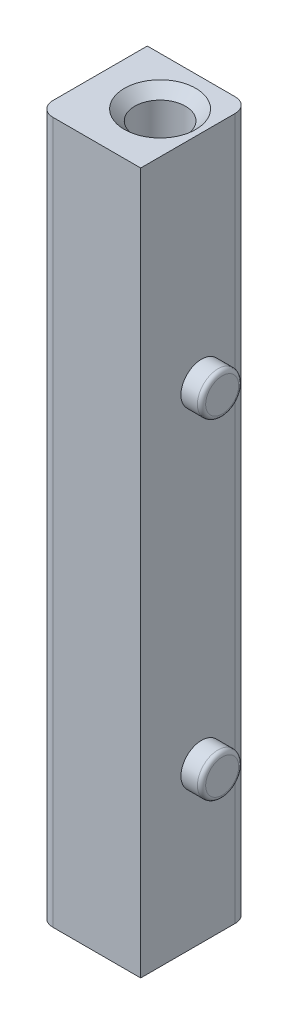
ISO-10303-21;
HEADER;
FILE_DESCRIPTION(('STEP AP214'),'2;1');
FILE_NAME('part.step','',(''),(''),'','','');
FILE_SCHEMA(('AUTOMOTIVE_DESIGN { 1 0 10303 214 1 1 1 1 }'));
ENDSEC;
DATA;
#1=APPLICATION_CONTEXT('core data for automotive mechanical design processes');
#2=APPLICATION_PROTOCOL_DEFINITION('international standard','automotive_design',2000,#1);
#3=PRODUCT_CONTEXT('',#1,'mechanical');
#4=PRODUCT('Part','Part','',(#3));
#5=PRODUCT_RELATED_PRODUCT_CATEGORY('part','',(#4));
#6=PRODUCT_DEFINITION_FORMATION('','',#4);
#7=PRODUCT_DEFINITION_CONTEXT('part definition',#1,'design');
#8=PRODUCT_DEFINITION('design','',#6,#7);
#9=PRODUCT_DEFINITION_SHAPE('','',#8);
#10=(LENGTH_UNIT() NAMED_UNIT(*) SI_UNIT(.MILLI.,.METRE.));
#11=(NAMED_UNIT(*) PLANE_ANGLE_UNIT() SI_UNIT($,.RADIAN.));
#12=(NAMED_UNIT(*) SI_UNIT($,.STERADIAN.) SOLID_ANGLE_UNIT());
#13=UNCERTAINTY_MEASURE_WITH_UNIT(LENGTH_MEASURE(1.E-05),#10,'distance_accuracy_value','');
#14=(GEOMETRIC_REPRESENTATION_CONTEXT(3) GLOBAL_UNCERTAINTY_ASSIGNED_CONTEXT((#13)) GLOBAL_UNIT_ASSIGNED_CONTEXT((#10,
#11,#12)) REPRESENTATION_CONTEXT('',''));
#15=CARTESIAN_POINT('',(0.,0.,0.));
#16=DIRECTION('',(0.,0.,1.));
#17=DIRECTION('',(1.,0.,0.));
#18=AXIS2_PLACEMENT_3D('',#15,#16,#17);
#19=CARTESIAN_POINT('',(5.1054,-39.37,-5.9182));
#20=DIRECTION('',(1.,0.,0.));
#21=DIRECTION('',(0.,0.,-1.));
#22=AXIS2_PLACEMENT_3D('',#19,#20,#21);
#23=PLANE('',#22);
#24=CARTESIAN_POINT('',(5.1054,20.32,0.));
#25=DIRECTION('',(1.,0.,0.));
#26=DIRECTION('',(0.,0.,-1.));
#27=AXIS2_PLACEMENT_3D('',#24,#25,#26);
#28=CIRCLE('',#27,2.54);
#29=CARTESIAN_POINT('',(5.1054,20.32,-2.54));
#30=VERTEX_POINT('',#29);
#31=EDGE_CURVE('E133',#30,#30,#28,.T.);
#32=ORIENTED_EDGE('',*,*,#31,.F.);
#33=EDGE_LOOP('',(#32));
#34=FACE_BOUND('',#33,.T.);
#35=DIRECTION('',(0.,0.,-1.));
#36=VECTOR('',#35,1.);
#37=CARTESIAN_POINT('',(5.1054,-39.37,-5.9182));
#38=LINE('',#37,#36);
#39=CARTESIAN_POINT('',(5.1054,-39.37,7.493));
#40=VERTEX_POINT('',#39);
#41=CARTESIAN_POINT('',(5.1054,-39.37,-4.1402));
#42=VERTEX_POINT('',#41);
#43=EDGE_CURVE('E122',#40,#42,#38,.T.);
#44=ORIENTED_EDGE('',*,*,#43,.T.);
#45=DIRECTION('',(0.,1.,0.));
#46=VECTOR('',#45,1.);
#47=CARTESIAN_POINT('',(5.1054,-39.37,-4.1402));
#48=LINE('',#47,#46);
#49=CARTESIAN_POINT('',(5.1054,46.99,-4.1402));
#50=VERTEX_POINT('',#49);
#51=EDGE_CURVE('E112',#42,#50,#48,.T.);
#52=ORIENTED_EDGE('',*,*,#51,.T.);
#53=DIRECTION('',(0.,0.,-1.));
#54=VECTOR('',#53,1.);
#55=CARTESIAN_POINT('',(5.1054,46.99,-5.9182));
#56=LINE('',#55,#54);
#57=CARTESIAN_POINT('',(5.1054,46.99,7.493));
#58=VERTEX_POINT('',#57);
#59=EDGE_CURVE('E94',#58,#50,#56,.T.);
#60=ORIENTED_EDGE('',*,*,#59,.F.);
#61=DIRECTION('',(0.,1.,0.));
#62=VECTOR('',#61,1.);
#63=CARTESIAN_POINT('',(5.1054,-39.37,7.493));
#64=LINE('',#63,#62);
#65=EDGE_CURVE('E101',#40,#58,#64,.T.);
#66=ORIENTED_EDGE('',*,*,#65,.F.);
#67=EDGE_LOOP('',(#44,#52,#60,#66));
#68=FACE_BOUND('',#67,.T.);
#69=CARTESIAN_POINT('',(5.1054,-20.32,0.));
#70=DIRECTION('',(1.,0.,0.));
#71=DIRECTION('',(0.,0.,-1.));
#72=AXIS2_PLACEMENT_3D('',#69,#70,#71);
#73=CIRCLE('',#72,2.54);
#74=CARTESIAN_POINT('',(5.1054,-20.32,-2.54));
#75=VERTEX_POINT('',#74);
#76=EDGE_CURVE('E208',#75,#75,#73,.T.);
#77=ORIENTED_EDGE('',*,*,#76,.F.);
#78=EDGE_LOOP('',(#77));
#79=FACE_BOUND('',#78,.T.);
#80=ADVANCED_FACE('F34',(#34,#68,#79),#23,.T.);
#81=CARTESIAN_POINT('',(-7.493,-39.37,-5.9182));
#82=DIRECTION('',(-1.,0.,0.));
#83=DIRECTION('',(0.,0.,1.));
#84=AXIS2_PLACEMENT_3D('',#81,#82,#83);
#85=PLANE('',#84);
#86=DIRECTION('',(0.,0.,1.));
#87=VECTOR('',#86,1.);
#88=CARTESIAN_POINT('',(-7.493,-39.37,-5.9182));
#89=LINE('',#88,#87);
#90=CARTESIAN_POINT('',(-7.493,-39.37,-5.9182));
#91=VERTEX_POINT('',#90);
#92=CARTESIAN_POINT('',(-7.493,-39.37,5.715));
#93=VERTEX_POINT('',#92);
#94=EDGE_CURVE('E115',#91,#93,#89,.T.);
#95=ORIENTED_EDGE('',*,*,#94,.T.);
#96=DIRECTION('',(0.,1.,0.));
#97=VECTOR('',#96,1.);
#98=CARTESIAN_POINT('',(-7.493,-39.37,5.715));
#99=LINE('',#98,#97);
#100=CARTESIAN_POINT('',(-7.493,46.99,5.715));
#101=VERTEX_POINT('',#100);
#102=EDGE_CURVE('E142',#93,#101,#99,.T.);
#103=ORIENTED_EDGE('',*,*,#102,.T.);
#104=DIRECTION('',(0.,0.,1.));
#105=VECTOR('',#104,1.);
#106=CARTESIAN_POINT('',(-7.493,46.99,-5.9182));
#107=LINE('',#106,#105);
#108=CARTESIAN_POINT('',(-7.493,46.99,-5.9182));
#109=VERTEX_POINT('',#108);
#110=EDGE_CURVE('E98',#109,#101,#107,.T.);
#111=ORIENTED_EDGE('',*,*,#110,.F.);
#112=DIRECTION('',(0.,1.,0.));
#113=VECTOR('',#112,1.);
#114=CARTESIAN_POINT('',(-7.493,-39.37,-5.9182));
#115=LINE('',#114,#113);
#116=EDGE_CURVE('E106',#91,#109,#115,.T.);
#117=ORIENTED_EDGE('',*,*,#116,.F.);
#118=EDGE_LOOP('',(#95,#103,#111,#117));
#119=FACE_BOUND('',#118,.T.);
#120=ADVANCED_FACE('F170',(#119),#85,.T.);
#121=CARTESIAN_POINT('',(-7.493,-39.37,-5.9182));
#122=DIRECTION('',(0.,0.,-1.));
#123=DIRECTION('',(-1.,0.,0.));
#124=AXIS2_PLACEMENT_3D('',#121,#122,#123);
#125=PLANE('',#124);
#126=DIRECTION('',(-1.,0.,0.));
#127=VECTOR('',#126,1.);
#128=CARTESIAN_POINT('',(-7.493,46.99,-5.9182));
#129=LINE('',#128,#127);
#130=CARTESIAN_POINT('',(3.3274,46.99,-5.9182));
#131=VERTEX_POINT('',#130);
#132=EDGE_CURVE('E113',#131,#109,#129,.T.);
#133=ORIENTED_EDGE('',*,*,#132,.F.);
#134=DIRECTION('',(0.,1.,0.));
#135=VECTOR('',#134,1.);
#136=CARTESIAN_POINT('',(3.3274,-39.37,-5.9182));
#137=LINE('',#136,#135);
#138=CARTESIAN_POINT('',(3.3274,-39.37,-5.9182));
#139=VERTEX_POINT('',#138);
#140=EDGE_CURVE('E57',#131,#139,#137,.F.);
#141=ORIENTED_EDGE('',*,*,#140,.T.);
#142=DIRECTION('',(-1.,0.,0.));
#143=VECTOR('',#142,1.);
#144=CARTESIAN_POINT('',(-7.493,-39.37,-5.9182));
#145=LINE('',#144,#143);
#146=EDGE_CURVE('E107',#139,#91,#145,.T.);
#147=ORIENTED_EDGE('',*,*,#146,.T.);
#148=ORIENTED_EDGE('',*,*,#116,.T.);
#149=EDGE_LOOP('',(#133,#141,#147,#148));
#150=FACE_BOUND('',#149,.T.);
#151=ADVANCED_FACE('F176',(#150),#125,.T.);
#152=CARTESIAN_POINT('',(-7.493,-39.37,7.493));
#153=DIRECTION('',(0.,0.,1.));
#154=DIRECTION('',(1.,0.,0.));
#155=AXIS2_PLACEMENT_3D('',#152,#153,#154);
#156=PLANE('',#155);
#157=DIRECTION('',(1.,0.,0.));
#158=VECTOR('',#157,1.);
#159=CARTESIAN_POINT('',(-7.493,46.99,7.493));
#160=LINE('',#159,#158);
#161=CARTESIAN_POINT('',(-5.715,46.99,7.493));
#162=VERTEX_POINT('',#161);
#163=EDGE_CURVE('E89',#162,#58,#160,.T.);
#164=ORIENTED_EDGE('',*,*,#163,.F.);
#165=DIRECTION('',(0.,1.,0.));
#166=VECTOR('',#165,1.);
#167=CARTESIAN_POINT('',(-5.715,-39.37,7.493));
#168=LINE('',#167,#166);
#169=CARTESIAN_POINT('',(-5.715,-39.37,7.493));
#170=VERTEX_POINT('',#169);
#171=EDGE_CURVE('E148',#162,#170,#168,.F.);
#172=ORIENTED_EDGE('',*,*,#171,.T.);
#173=DIRECTION('',(1.,0.,0.));
#174=VECTOR('',#173,1.);
#175=CARTESIAN_POINT('',(-7.493,-39.37,7.493));
#176=LINE('',#175,#174);
#177=EDGE_CURVE('E104',#170,#40,#176,.T.);
#178=ORIENTED_EDGE('',*,*,#177,.T.);
#179=ORIENTED_EDGE('',*,*,#65,.T.);
#180=EDGE_LOOP('',(#164,#172,#178,#179));
#181=FACE_BOUND('',#180,.T.);
#182=ADVANCED_FACE('F102',(#181),#156,.T.);
#183=CARTESIAN_POINT('',(-7.493,-39.37,7.493));
#184=DIRECTION('',(0.,1.,0.));
#185=DIRECTION('',(0.,0.,1.));
#186=AXIS2_PLACEMENT_3D('',#183,#184,#185);
#187=PLANE('',#186);
#188=CARTESIAN_POINT('',(0.,-39.37,0.));
#189=DIRECTION('',(0.,1.,0.));
#190=DIRECTION('',(0.,0.,1.));
#191=AXIS2_PLACEMENT_3D('',#188,#189,#190);
#192=CIRCLE('',#191,3.1242);
#193=CARTESIAN_POINT('',(0.,-39.37,3.1242));
#194=VERTEX_POINT('',#193);
#195=EDGE_CURVE('E206',#194,#194,#192,.T.);
#196=ORIENTED_EDGE('',*,*,#195,.T.);
#197=EDGE_LOOP('',(#196));
#198=FACE_BOUND('',#197,.T.);
#199=ORIENTED_EDGE('',*,*,#177,.F.);
#200=CARTESIAN_POINT('',(-5.715,-39.37,5.715));
#201=DIRECTION('',(0.,1.,0.));
#202=DIRECTION('',(0.,0.,1.));
#203=AXIS2_PLACEMENT_3D('',#200,#201,#202);
#204=CIRCLE('',#203,1.778);
#205=EDGE_CURVE('E151',#170,#93,#204,.F.);
#206=ORIENTED_EDGE('',*,*,#205,.T.);
#207=ORIENTED_EDGE('',*,*,#94,.F.);
#208=ORIENTED_EDGE('',*,*,#146,.F.);
#209=CARTESIAN_POINT('',(3.3274,-39.37,-4.1402));
#210=DIRECTION('',(0.,1.,0.));
#211=DIRECTION('',(0.,0.,1.));
#212=AXIS2_PLACEMENT_3D('',#209,#210,#211);
#213=CIRCLE('',#212,1.778);
#214=EDGE_CURVE('E49',#139,#42,#213,.F.);
#215=ORIENTED_EDGE('',*,*,#214,.T.);
#216=ORIENTED_EDGE('',*,*,#43,.F.);
#217=EDGE_LOOP('',(#199,#206,#207,#208,#215,#216));
#218=FACE_BOUND('',#217,.T.);
#219=ADVANCED_FACE('F184',(#198,#218),#187,.F.);
#220=CARTESIAN_POINT('',(-7.493,46.99,7.493));
#221=DIRECTION('',(0.,1.,0.));
#222=DIRECTION('',(0.,0.,1.));
#223=AXIS2_PLACEMENT_3D('',#220,#221,#222);
#224=PLANE('',#223);
#225=CARTESIAN_POINT('',(0.,46.99,0.));
#226=DIRECTION('',(0.,1.,0.));
#227=DIRECTION('',(0.,0.,1.));
#228=AXIS2_PLACEMENT_3D('',#225,#226,#227);
#229=CIRCLE('',#228,4.39419999999997);
#230=CARTESIAN_POINT('',(0.,46.99,4.39419999999997));
#231=VERTEX_POINT('',#230);
#232=EDGE_CURVE('E11',#231,#231,#229,.F.);
#233=ORIENTED_EDGE('',*,*,#232,.T.);
#234=EDGE_LOOP('',(#233));
#235=FACE_BOUND('',#234,.T.);
#236=ORIENTED_EDGE('',*,*,#110,.T.);
#237=CARTESIAN_POINT('',(-5.715,46.99,5.715));
#238=DIRECTION('',(0.,1.,0.));
#239=DIRECTION('',(0.,0.,1.));
#240=AXIS2_PLACEMENT_3D('',#237,#238,#239);
#241=CIRCLE('',#240,1.778);
#242=EDGE_CURVE('E95',#101,#162,#241,.T.);
#243=ORIENTED_EDGE('',*,*,#242,.T.);
#244=ORIENTED_EDGE('',*,*,#163,.T.);
#245=ORIENTED_EDGE('',*,*,#59,.T.);
#246=CARTESIAN_POINT('',(3.3274,46.99,-4.1402));
#247=DIRECTION('',(0.,1.,0.));
#248=DIRECTION('',(0.,0.,1.));
#249=AXIS2_PLACEMENT_3D('',#246,#247,#248);
#250=CIRCLE('',#249,1.778);
#251=EDGE_CURVE('E145',#50,#131,#250,.T.);
#252=ORIENTED_EDGE('',*,*,#251,.T.);
#253=ORIENTED_EDGE('',*,*,#132,.T.);
#254=EDGE_LOOP('',(#236,#243,#244,#245,#252,#253));
#255=FACE_BOUND('',#254,.T.);
#256=ADVANCED_FACE('F92',(#235,#255),#224,.T.);
#257=CARTESIAN_POINT('',(0.,-39.37,0.));
#258=DIRECTION('',(0.,1.,0.));
#259=DIRECTION('',(0.,0.,1.));
#260=AXIS2_PLACEMENT_3D('',#257,#258,#259);
#261=CYLINDRICAL_SURFACE('',#260,3.1242);
#262=CARTESIAN_POINT('',(0.,45.72,0.));
#263=DIRECTION('',(0.,1.,0.));
#264=DIRECTION('',(0.,0.,1.));
#265=AXIS2_PLACEMENT_3D('',#262,#263,#264);
#266=CIRCLE('',#265,3.1242);
#267=CARTESIAN_POINT('',(0.,45.72,3.1242));
#268=VERTEX_POINT('',#267);
#269=EDGE_CURVE('E42',#268,#268,#266,.T.);
#270=ORIENTED_EDGE('',*,*,#269,.T.);
#271=EDGE_LOOP('',(#270));
#272=FACE_BOUND('',#271,.T.);
#273=ORIENTED_EDGE('',*,*,#195,.F.);
#274=EDGE_LOOP('',(#273));
#275=FACE_BOUND('',#274,.T.);
#276=ADVANCED_FACE('F157',(#272,#275),#261,.F.);
#277=CARTESIAN_POINT('',(7.6454,-20.32,0.));
#278=DIRECTION('',(-1.,0.,0.));
#279=DIRECTION('',(0.,0.,1.));
#280=AXIS2_PLACEMENT_3D('',#277,#278,#279);
#281=CYLINDRICAL_SURFACE('',#280,2.54);
#282=CARTESIAN_POINT('',(7.1374,-20.32,0.));
#283=DIRECTION('',(1.,0.,0.));
#284=DIRECTION('',(0.,0.,-1.));
#285=AXIS2_PLACEMENT_3D('',#282,#283,#284);
#286=CIRCLE('',#285,2.54);
#287=CARTESIAN_POINT('',(7.1374,-20.32,-2.54));
#288=VERTEX_POINT('',#287);
#289=EDGE_CURVE('E130',#288,#288,#286,.F.);
#290=ORIENTED_EDGE('',*,*,#289,.T.);
#291=EDGE_LOOP('',(#290));
#292=FACE_BOUND('',#291,.T.);
#293=ORIENTED_EDGE('',*,*,#76,.T.);
#294=EDGE_LOOP('',(#293));
#295=FACE_BOUND('',#294,.T.);
#296=ADVANCED_FACE('F214',(#292,#295),#281,.T.);
#297=CARTESIAN_POINT('',(7.6454,-20.32,0.));
#298=DIRECTION('',(1.,0.,0.));
#299=DIRECTION('',(0.,0.,-1.));
#300=AXIS2_PLACEMENT_3D('',#297,#298,#299);
#301=PLANE('',#300);
#302=CARTESIAN_POINT('',(7.6454,-20.32,0.));
#303=DIRECTION('',(1.,0.,0.));
#304=DIRECTION('',(0.,0.,-1.));
#305=AXIS2_PLACEMENT_3D('',#302,#303,#304);
#306=CIRCLE('',#305,2.032);
#307=CARTESIAN_POINT('',(7.6454,-20.32,-2.032));
#308=VERTEX_POINT('',#307);
#309=EDGE_CURVE('E126',#308,#308,#306,.T.);
#310=ORIENTED_EDGE('',*,*,#309,.T.);
#311=EDGE_LOOP('',(#310));
#312=FACE_BOUND('',#311,.T.);
#313=ADVANCED_FACE('F190',(#312),#301,.T.);
#314=CARTESIAN_POINT('',(7.1374,-20.32,0.));
#315=DIRECTION('',(1.,0.,0.));
#316=DIRECTION('',(0.,0.,-1.));
#317=AXIS2_PLACEMENT_3D('',#314,#315,#316);
#318=TOROIDAL_SURFACE('',#317,2.032,0.508);
#319=ORIENTED_EDGE('',*,*,#289,.F.);
#320=EDGE_LOOP('',(#319));
#321=FACE_BOUND('',#320,.T.);
#322=ORIENTED_EDGE('',*,*,#309,.F.);
#323=EDGE_LOOP('',(#322));
#324=FACE_BOUND('',#323,.T.);
#325=ADVANCED_FACE('F186',(#321,#324),#318,.T.);
#326=CARTESIAN_POINT('',(7.6454,20.32,0.));
#327=DIRECTION('',(-1.,0.,0.));
#328=DIRECTION('',(0.,0.,1.));
#329=AXIS2_PLACEMENT_3D('',#326,#327,#328);
#330=CYLINDRICAL_SURFACE('',#329,2.54);
#331=CARTESIAN_POINT('',(7.1374,20.32,0.));
#332=DIRECTION('',(1.,0.,0.));
#333=DIRECTION('',(0.,0.,-1.));
#334=AXIS2_PLACEMENT_3D('',#331,#332,#333);
#335=CIRCLE('',#334,2.54);
#336=CARTESIAN_POINT('',(7.1374,20.32,-2.54));
#337=VERTEX_POINT('',#336);
#338=EDGE_CURVE('E136',#337,#337,#335,.F.);
#339=ORIENTED_EDGE('',*,*,#338,.T.);
#340=EDGE_LOOP('',(#339));
#341=FACE_BOUND('',#340,.T.);
#342=ORIENTED_EDGE('',*,*,#31,.T.);
#343=EDGE_LOOP('',(#342));
#344=FACE_BOUND('',#343,.T.);
#345=ADVANCED_FACE('F189',(#341,#344),#330,.T.);
#346=CARTESIAN_POINT('',(7.6454,20.32,0.));
#347=DIRECTION('',(1.,0.,0.));
#348=DIRECTION('',(0.,0.,-1.));
#349=AXIS2_PLACEMENT_3D('',#346,#347,#348);
#350=PLANE('',#349);
#351=CARTESIAN_POINT('',(7.6454,20.32,0.));
#352=DIRECTION('',(1.,0.,0.));
#353=DIRECTION('',(0.,0.,-1.));
#354=AXIS2_PLACEMENT_3D('',#351,#352,#353);
#355=CIRCLE('',#354,2.032);
#356=CARTESIAN_POINT('',(7.6454,20.32,-2.032));
#357=VERTEX_POINT('',#356);
#358=EDGE_CURVE('E139',#357,#357,#355,.T.);
#359=ORIENTED_EDGE('',*,*,#358,.T.);
#360=EDGE_LOOP('',(#359));
#361=FACE_BOUND('',#360,.T.);
#362=ADVANCED_FACE('F195',(#361),#350,.T.);
#363=CARTESIAN_POINT('',(7.1374,20.32,0.));
#364=DIRECTION('',(1.,0.,0.));
#365=DIRECTION('',(0.,0.,-1.));
#366=AXIS2_PLACEMENT_3D('',#363,#364,#365);
#367=TOROIDAL_SURFACE('',#366,2.032,0.508);
#368=ORIENTED_EDGE('',*,*,#358,.F.);
#369=EDGE_LOOP('',(#368));
#370=FACE_BOUND('',#369,.T.);
#371=ORIENTED_EDGE('',*,*,#338,.F.);
#372=EDGE_LOOP('',(#371));
#373=FACE_BOUND('',#372,.T.);
#374=ADVANCED_FACE('F192',(#370,#373),#367,.T.);
#375=CARTESIAN_POINT('',(-5.715,-39.37,5.715));
#376=DIRECTION('',(0.,1.,0.));
#377=DIRECTION('',(0.,0.,1.));
#378=AXIS2_PLACEMENT_3D('',#375,#376,#377);
#379=CYLINDRICAL_SURFACE('',#378,1.778);
#380=ORIENTED_EDGE('',*,*,#205,.F.);
#381=ORIENTED_EDGE('',*,*,#171,.F.);
#382=ORIENTED_EDGE('',*,*,#242,.F.);
#383=ORIENTED_EDGE('',*,*,#102,.F.);
#384=EDGE_LOOP('',(#380,#381,#382,#383));
#385=FACE_BOUND('',#384,.T.);
#386=ADVANCED_FACE('F166',(#385),#379,.T.);
#387=CARTESIAN_POINT('',(3.3274,-39.37,-4.1402));
#388=DIRECTION('',(0.,1.,0.));
#389=DIRECTION('',(0.,0.,1.));
#390=AXIS2_PLACEMENT_3D('',#387,#388,#389);
#391=CYLINDRICAL_SURFACE('',#390,1.778);
#392=ORIENTED_EDGE('',*,*,#214,.F.);
#393=ORIENTED_EDGE('',*,*,#140,.F.);
#394=ORIENTED_EDGE('',*,*,#251,.F.);
#395=ORIENTED_EDGE('',*,*,#51,.F.);
#396=EDGE_LOOP('',(#392,#393,#394,#395));
#397=FACE_BOUND('',#396,.T.);
#398=ADVANCED_FACE('F161',(#397),#391,.T.);
#399=CARTESIAN_POINT('',(0.,45.72,0.));
#400=DIRECTION('',(0.,1.,0.));
#401=DIRECTION('',(0.,0.,1.));
#402=AXIS2_PLACEMENT_3D('',#399,#400,#401);
#403=CONICAL_SURFACE('',#402,3.1242,0.785398163397451);
#404=ORIENTED_EDGE('',*,*,#232,.F.);
#405=EDGE_LOOP('',(#404));
#406=FACE_BOUND('',#405,.T.);
#407=ORIENTED_EDGE('',*,*,#269,.F.);
#408=EDGE_LOOP('',(#407));
#409=FACE_BOUND('',#408,.T.);
#410=ADVANCED_FACE('F36',(#406,#409),#403,.F.);
#411=CLOSED_SHELL('',(#80,#120,#151,#182,#219,#256,#276,#296,#313,#325,#345,#362,#374,#386,#398,#410));
#412=MANIFOLD_SOLID_BREP('B2',#411);
#413=ADVANCED_BREP_SHAPE_REPRESENTATION('',(#18,#412),#14);
#414=SHAPE_DEFINITION_REPRESENTATION(#9,#413);
ENDSEC;
END-ISO-10303-21;
